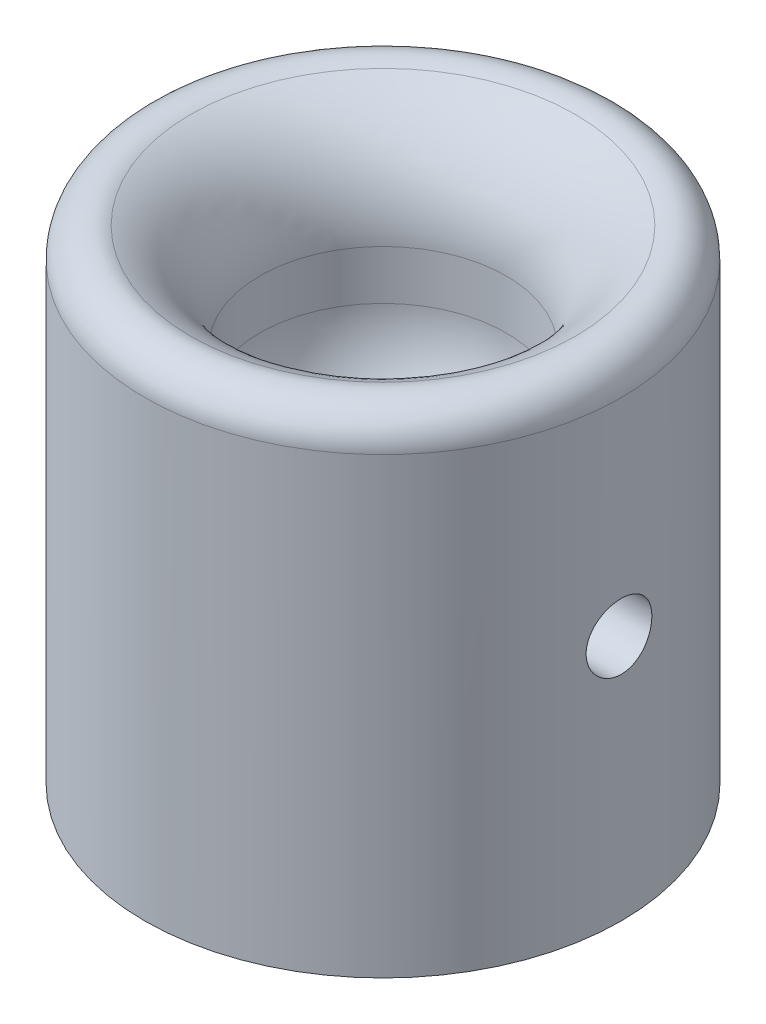
ISO-10303-21;
HEADER;
FILE_DESCRIPTION(('STEP AP214'),'2;1');
FILE_NAME('part.step','',(''),(''),'','','');
FILE_SCHEMA(('AUTOMOTIVE_DESIGN { 1 0 10303 214 1 1 1 1 }'));
ENDSEC;
DATA;
#1=APPLICATION_CONTEXT('core data for automotive mechanical design processes');
#2=APPLICATION_PROTOCOL_DEFINITION('international standard','automotive_design',2000,#1);
#3=PRODUCT_CONTEXT('',#1,'mechanical');
#4=PRODUCT('Part','Part','',(#3));
#5=PRODUCT_RELATED_PRODUCT_CATEGORY('part','',(#4));
#6=PRODUCT_DEFINITION_FORMATION('','',#4);
#7=PRODUCT_DEFINITION_CONTEXT('part definition',#1,'design');
#8=PRODUCT_DEFINITION('design','',#6,#7);
#9=PRODUCT_DEFINITION_SHAPE('','',#8);
#10=(LENGTH_UNIT() NAMED_UNIT(*) SI_UNIT(.MILLI.,.METRE.));
#11=(NAMED_UNIT(*) PLANE_ANGLE_UNIT() SI_UNIT($,.RADIAN.));
#12=(NAMED_UNIT(*) SI_UNIT($,.STERADIAN.) SOLID_ANGLE_UNIT());
#13=UNCERTAINTY_MEASURE_WITH_UNIT(LENGTH_MEASURE(1.E-05),#10,'distance_accuracy_value','');
#14=(GEOMETRIC_REPRESENTATION_CONTEXT(3) GLOBAL_UNCERTAINTY_ASSIGNED_CONTEXT((#13)) GLOBAL_UNIT_ASSIGNED_CONTEXT((#10,
#11,#12)) REPRESENTATION_CONTEXT('',''));
#15=CARTESIAN_POINT('',(0.,0.,0.));
#16=DIRECTION('',(0.,0.,1.));
#17=DIRECTION('',(1.,0.,0.));
#18=AXIS2_PLACEMENT_3D('',#15,#16,#17);
#19=CARTESIAN_POINT('',(0.,0.,0.));
#20=DIRECTION('',(0.,1.,0.));
#21=DIRECTION('',(0.,0.,1.));
#22=AXIS2_PLACEMENT_3D('',#19,#20,#21);
#23=PLANE('',#22);
#24=CARTESIAN_POINT('',(7.25,0.,0.));
#25=DIRECTION('',(0.,1.,0.));
#26=DIRECTION('',(0.,0.,1.));
#27=AXIS2_PLACEMENT_3D('',#24,#25,#26);
#28=CIRCLE('',#27,2.);
#29=CARTESIAN_POINT('',(7.25,0.,2.));
#30=VERTEX_POINT('',#29);
#31=EDGE_CURVE('E94',#30,#30,#28,.F.);
#32=ORIENTED_EDGE('',*,*,#31,.F.);
#33=EDGE_LOOP('',(#32));
#34=FACE_BOUND('',#33,.T.);
#35=CARTESIAN_POINT('',(0.,0.,0.));
#36=DIRECTION('',(0.,1.,0.));
#37=DIRECTION('',(0.,0.,1.));
#38=AXIS2_PLACEMENT_3D('',#35,#36,#37);
#39=CIRCLE('',#38,14.5);
#40=CARTESIAN_POINT('',(0.,0.,14.5));
#41=VERTEX_POINT('',#40);
#42=EDGE_CURVE('E127',#41,#41,#39,.T.);
#43=ORIENTED_EDGE('',*,*,#42,.F.);
#44=EDGE_LOOP('',(#43));
#45=FACE_BOUND('',#44,.T.);
#46=CARTESIAN_POINT('',(0.,0.,0.));
#47=DIRECTION('',(0.,1.,0.));
#48=DIRECTION('',(0.,0.,1.));
#49=AXIS2_PLACEMENT_3D('',#46,#47,#48);
#50=CIRCLE('',#49,3.175);
#51=CARTESIAN_POINT('',(0.,0.,3.175));
#52=VERTEX_POINT('',#51);
#53=EDGE_CURVE('E131',#52,#52,#50,.T.);
#54=ORIENTED_EDGE('',*,*,#53,.T.);
#55=EDGE_LOOP('',(#54));
#56=FACE_BOUND('',#55,.T.);
#57=CARTESIAN_POINT('',(-7.25,0.,0.));
#58=DIRECTION('',(0.,1.,0.));
#59=DIRECTION('',(0.,0.,1.));
#60=AXIS2_PLACEMENT_3D('',#57,#58,#59);
#61=CIRCLE('',#60,2.);
#62=CARTESIAN_POINT('',(-7.25,0.,2.));
#63=VERTEX_POINT('',#62);
#64=EDGE_CURVE('E65',#63,#63,#61,.T.);
#65=ORIENTED_EDGE('',*,*,#64,.T.);
#66=EDGE_LOOP('',(#65));
#67=FACE_BOUND('',#66,.T.);
#68=ADVANCED_FACE('F33',(#34,#45,#56,#67),#23,.F.);
#69=CARTESIAN_POINT('',(0.,30.,0.));
#70=DIRECTION('',(0.,-1.,0.));
#71=DIRECTION('',(0.,0.,-1.));
#72=AXIS2_PLACEMENT_3D('',#69,#70,#71);
#73=CYLINDRICAL_SURFACE('',#72,14.5);
#74=CARTESIAN_POINT('',(-14.5,13.,0.));
#75=CARTESIAN_POINT('',(-14.4999983145304,13.0000046834474,-0.111771782255016));
#76=CARTESIAN_POINT('',(-14.4986940304641,13.0094013112958,-0.223610945467072));
#77=CARTESIAN_POINT('',(-14.4936164731435,13.0467340474412,-0.444170253150493));
#78=CARTESIAN_POINT('',(-14.4898407079737,13.0746888677756,-0.552887133913179));
#79=CARTESIAN_POINT('',(-14.4802450300764,13.148292773718,-0.763977449731496));
#80=CARTESIAN_POINT('',(-14.4744265776484,13.1939292212912,-0.866355355121735));
#81=CARTESIAN_POINT('',(-14.4613905746173,13.3015716315056,-1.06198220004484));
#82=CARTESIAN_POINT('',(-14.4541732413289,13.3635750520949,-1.15523255415147));
#83=CARTESIAN_POINT('',(-14.439090026744,13.5026313545902,-1.33059490257932));
#84=CARTESIAN_POINT('',(-14.4312205466596,13.5797714697079,-1.4126374216345));
#85=CARTESIAN_POINT('',(-14.4157485695573,13.7467238679877,-1.56265631524633));
#86=CARTESIAN_POINT('',(-14.4081460870026,13.83653683632,-1.63063192877154));
#87=CARTESIAN_POINT('',(-14.3940337797335,14.0267448609364,-1.75085222768552));
#88=CARTESIAN_POINT('',(-14.387528601152,14.1271821215137,-1.80303073157084));
#89=CARTESIAN_POINT('',(-14.3763958401487,14.3354990276636,-1.88975287311594));
#90=CARTESIAN_POINT('',(-14.371768171242,14.4433783301613,-1.92429732308241));
#91=CARTESIAN_POINT('',(-14.364949334221,14.662790834289,-1.97455724619643));
#92=CARTESIAN_POINT('',(-14.3627428801251,14.7742964820044,-1.99039089662152));
#93=CARTESIAN_POINT('',(-14.3609697255537,14.9984023425616,-2.00314565332517));
#94=CARTESIAN_POINT('',(-14.3614028965333,15.1110025018361,-2.00006768056576));
#95=CARTESIAN_POINT('',(-14.3648460628672,15.3332719590756,-1.97518335555223));
#96=CARTESIAN_POINT('',(-14.3678380491279,15.4429562294512,-1.95350789010315));
#97=CARTESIAN_POINT('',(-14.3760336186403,15.65711578347,-1.89224841606513));
#98=CARTESIAN_POINT('',(-14.381237255547,15.7615909406705,-1.85266397299995));
#99=CARTESIAN_POINT('',(-14.3932899730117,15.9627690631382,-1.756571779847));
#100=CARTESIAN_POINT('',(-14.4001444992213,16.0594448621523,-1.7000078655931));
#101=CARTESIAN_POINT('',(-14.4147225990986,16.2419820617624,-1.57160245870337));
#102=CARTESIAN_POINT('',(-14.4224462210843,16.3278428605296,-1.4997601164572));
#103=CARTESIAN_POINT('',(-14.4379720826066,16.4870719413738,-1.34211523789643));
#104=CARTESIAN_POINT('',(-14.4457744356076,16.5603287010207,-1.25620002309771));
#105=CARTESIAN_POINT('',(-14.4605178909198,16.6913994643883,-1.07323422973863));
#106=CARTESIAN_POINT('',(-14.4674589904367,16.7492134180034,-0.976183615049901));
#107=CARTESIAN_POINT('',(-14.4797035649538,16.8477603126541,-0.773610653626885));
#108=CARTESIAN_POINT('',(-14.485006293298,16.8884854688179,-0.668084471836535));
#109=CARTESIAN_POINT('',(-14.4933701764699,16.9516060432217,-0.451601724985182));
#110=CARTESIAN_POINT('',(-14.4964314592463,16.974002507728,-0.340645470275087));
#111=CARTESIAN_POINT('',(-14.499950744306,16.9996835478943,-0.117415617081674));
#112=CARTESIAN_POINT('',(-14.5004296509885,17.0031215975551,-0.00515999171125079));
#113=CARTESIAN_POINT('',(-14.4987868946504,16.991194396561,0.21832598143994));
#114=CARTESIAN_POINT('',(-14.4966652993867,16.9758296358204,0.329556355857925));
#115=CARTESIAN_POINT('',(-14.4900728834365,16.9268605319016,0.547375596838828));
#116=CARTESIAN_POINT('',(-14.4856115920925,16.8933301572435,0.653981405715147));
#117=CARTESIAN_POINT('',(-14.4748387848992,16.809059076077,0.860057551874811));
#118=CARTESIAN_POINT('',(-14.4685271940518,16.7583176719418,0.959527599721316));
#119=CARTESIAN_POINT('',(-14.4547042200532,16.6406991584116,1.14918885020547));
#120=CARTESIAN_POINT('',(-14.4471856237026,16.5737237216429,1.23931854001307));
#121=CARTESIAN_POINT('',(-14.4318102158341,16.425676333861,1.40711288875201));
#122=CARTESIAN_POINT('',(-14.423953387849,16.3446036959156,1.4847769398995));
#123=CARTESIAN_POINT('',(-14.4087216361406,16.169983584765,1.6259868573837));
#124=CARTESIAN_POINT('',(-14.4013504582519,16.0763529994696,1.68943041154324));
#125=CARTESIAN_POINT('',(-14.3879885861327,15.879674249697,1.79968944890341));
#126=CARTESIAN_POINT('',(-14.3819978593068,15.776626307664,1.84650532473323));
#127=CARTESIAN_POINT('',(-14.3721015450655,15.5643556952836,1.92201791311758));
#128=CARTESIAN_POINT('',(-14.3681895447425,15.455153178665,1.95077040216642));
#129=CARTESIAN_POINT('',(-14.3628759068918,15.2334119663617,1.98951867875624));
#130=CARTESIAN_POINT('',(-14.3614741248611,15.1208734630953,1.99951554598356));
#131=CARTESIAN_POINT('',(-14.3613444524612,14.8966735724001,2.0004460782285));
#132=CARTESIAN_POINT('',(-14.3625940089465,14.7850128316856,1.99154053307902));
#133=CARTESIAN_POINT('',(-14.3675774730918,14.56479230137,1.9552615439198));
#134=CARTESIAN_POINT('',(-14.3713113790711,14.4562325096709,1.9278881124051));
#135=CARTESIAN_POINT('',(-14.3808353986625,14.2453283043831,1.85550397444985));
#136=CARTESIAN_POINT('',(-14.3866244057225,14.1429805806169,1.81050275819885));
#137=CARTESIAN_POINT('',(-14.399607924192,13.94726243623,1.7041562957287));
#138=CARTESIAN_POINT('',(-14.4068024682007,13.8538922239025,1.64281067041651));
#139=CARTESIAN_POINT('',(-14.421859538483,13.6779599238143,1.5049261358674));
#140=CARTESIAN_POINT('',(-14.4297270218845,13.5954919216411,1.42826770925532));
#141=CARTESIAN_POINT('',(-14.4452008978638,13.4445313255069,1.2621853422954));
#142=CARTESIAN_POINT('',(-14.4528072289262,13.3760420057456,1.17275841952479));
#143=CARTESIAN_POINT('',(-14.4669414028435,13.2547056876633,0.983195939897374));
#144=CARTESIAN_POINT('',(-14.4734640935461,13.2019325205128,0.883012756117933));
#145=CARTESIAN_POINT('',(-14.4846448909311,13.1140376339926,0.675166996113411));
#146=CARTESIAN_POINT('',(-14.4893049758408,13.07889717717,0.567512498421442));
#147=CARTESIAN_POINT('',(-14.4951414673414,13.0354605147008,0.382780409393608));
#148=CARTESIAN_POINT('',(-14.4969543048092,13.0221825251959,0.306856193752554));
#149=CARTESIAN_POINT('',(-14.4993841458831,13.0044506975116,0.153965304348375));
#150=CARTESIAN_POINT('',(-14.5000011611059,12.9999967736125,0.0769986407192193));
#151=CARTESIAN_POINT('',(-14.5,13.,0.));
#152=B_SPLINE_CURVE_WITH_KNOTS('',3,(#74,#75,#76,#77,#78,#79,#80,#81,#82,#83,#84,#85,#86,#87,
#88,#89,#90,#91,#92,#93,#94,#95,#96,#97,#98,#99,#100,#101,#102,#103,#104,#105,#106,#107,#108,
#109,#110,#111,#112,#113,#114,#115,#116,#117,#118,#119,#120,#121,#122,#123,#124,#125,#126,#127,
#128,#129,#130,#131,#132,#133,#134,#135,#136,#137,#138,#139,#140,#141,#142,#143,#144,#145,#146,
#147,#148,#149,#150,#151),.UNSPECIFIED.,.T.,.F.,(4,2,2,2,2,2,2,2,2,2,2,2,2,2,2,2,2,2,2,2,2,2,2,
2,2,2,2,2,2,2,2,2,2,2,2,2,2,2,4),(0.,0.335034041900406,0.670406409349955,1.00553950856274,
1.34062058685763,1.67769268156906,2.01478300740016,2.35326661939162,2.69173463784306,
3.02805327039063,3.36435552495573,3.69831016124934,4.0322728997999,4.36735271595418,
4.70245117026609,5.04037712041041,5.3783041669734,5.71638499089566,6.05444651462918,
6.38976726737104,6.72507928339099,7.05903609419514,7.393006443123,7.72905250208165,
8.06511494057562,8.40352272845118,8.74192252497614,9.07927220045392,9.4166024554605,
9.75107477879538,10.0855468758325,10.4198391515971,10.7541391816283,11.0911582656328,
11.428256198602,11.766913632115,12.105210424081,12.3360147997982,12.5668169334006),.UNSPECIFIED.);
#153=CARTESIAN_POINT('',(-14.5,13.,0.));
#154=VERTEX_POINT('',#153);
#155=EDGE_CURVE('E93',#154,#154,#152,.T.);
#156=ORIENTED_EDGE('',*,*,#155,.T.);
#157=EDGE_LOOP('',(#156));
#158=FACE_BOUND('',#157,.T.);
#159=CARTESIAN_POINT('',(14.3614066163451,15.,-2.));
#160=CARTESIAN_POINT('',(14.3614083625701,14.8882339192475,-1.99999531160166));
#161=CARTESIAN_POINT('',(14.3627254295864,14.776400441491,-1.99059961001874));
#162=CARTESIAN_POINT('',(14.3678486244426,14.5558529449147,-1.95327088709236));
#163=CARTESIAN_POINT('',(14.371657267476,14.447142194309,-1.92531913338241));
#164=CARTESIAN_POINT('',(14.3813242074303,14.2360648468641,-1.8517241965142));
#165=CARTESIAN_POINT('',(14.3871810230401,14.133693727794,-1.80609379661412));
#166=CARTESIAN_POINT('',(14.4002826236974,13.9380782758978,-1.69846563271024));
#167=CARTESIAN_POINT('',(14.4075271943674,13.8448325367585,-1.63647039615496));
#168=CARTESIAN_POINT('',(14.4226430437203,13.6694650682146,-1.4974223989857));
#169=CARTESIAN_POINT('',(14.4305178577144,13.5874142543897,-1.42028057335359));
#170=CARTESIAN_POINT('',(14.4459752335317,13.4373793256453,-1.25332125913333));
#171=CARTESIAN_POINT('',(14.4535577800559,13.3693959462836,-1.16350310813857));
#172=CARTESIAN_POINT('',(14.4676128967092,13.2491674541495,-0.973290452287546));
#173=CARTESIAN_POINT('',(14.4740808528128,13.1969871164741,-0.872854634802141));
#174=CARTESIAN_POINT('',(14.4851390104675,13.1102611878165,-0.664540862123759));
#175=CARTESIAN_POINT('',(14.4897292962705,13.0757148055738,-0.556663241101609));
#176=CARTESIAN_POINT('',(14.4964899898084,13.0254509515881,-0.337256253733143));
#177=CARTESIAN_POINT('',(14.4986756058742,13.0096150974716,-0.225754483713472));
#178=CARTESIAN_POINT('',(14.5004327314837,12.9968545894437,-0.00165624290616804));
#179=CARTESIAN_POINT('',(14.5000043649225,12.9999290392398,0.110940175745803));
#180=CARTESIAN_POINT('',(14.496594018656,13.024807713458,0.333224973143078));
#181=CARTESIAN_POINT('',(14.4936294005615,13.0464846002245,0.442927907846335));
#182=CARTESIAN_POINT('',(14.4854990487806,13.1077533580355,0.657124053813943));
#183=CARTESIAN_POINT('',(14.4803332657409,13.147345630771,0.761617148207219));
#184=CARTESIAN_POINT('',(14.4683510916218,13.243454184091,0.962817297353837));
#185=CARTESIAN_POINT('',(14.4615294122443,13.3000248267298,1.05949805689999));
#186=CARTESIAN_POINT('',(14.4469972159453,13.4284446741172,1.24204233885163));
#187=CARTESIAN_POINT('',(14.4392866494628,13.500294730977,1.32790525753614));
#188=CARTESIAN_POINT('',(14.4237623969894,13.6579451742219,1.48712589886147));
#189=CARTESIAN_POINT('',(14.4159483867633,13.7438566411935,1.56037364831337));
#190=CARTESIAN_POINT('',(14.401160871778,13.9268116931912,1.69142800485719));
#191=CARTESIAN_POINT('',(14.3941873707967,14.0238553282505,1.74923454254509));
#192=CARTESIAN_POINT('',(14.3818706412671,14.2264262083133,1.84777606376466));
#193=CARTESIAN_POINT('',(14.3765283720676,14.3319583996345,1.88850100662797));
#194=CARTESIAN_POINT('',(14.3680967931091,14.5484542369869,1.9516193216908));
#195=CARTESIAN_POINT('',(14.3650073501391,14.6594175614578,1.97401377779272));
#196=CARTESIAN_POINT('',(14.3614560645899,14.8826510022969,1.99968722359251));
#197=CARTESIAN_POINT('',(14.3609728721167,14.9949029280791,2.00312153655887));
#198=CARTESIAN_POINT('',(14.3626322271079,15.2183806116254,1.99118818249391));
#199=CARTESIAN_POINT('',(14.3647747060568,15.3296063960898,1.97582100607775));
#200=CARTESIAN_POINT('',(14.3714244566748,15.5474012725679,1.92685214913448));
#201=CARTESIAN_POINT('',(14.3759218326507,15.6539878445944,1.89332675253117));
#202=CARTESIAN_POINT('',(14.3867665521429,15.86002771211,1.80907205016032));
#203=CARTESIAN_POINT('',(14.3931139738674,15.959480705815,1.75834201707481));
#204=CARTESIAN_POINT('',(14.406994323589,16.1491298505101,1.64074051048974));
#205=CARTESIAN_POINT('',(14.4145345775159,16.2392626966977,1.57376782819061));
#206=CARTESIAN_POINT('',(14.4299284726678,16.407064691853,1.42572402089194));
#207=CARTESIAN_POINT('',(14.4377821287892,16.4847332474926,1.34465222512572));
#208=CARTESIAN_POINT('',(14.4529840811805,16.625953594722,1.17003025307234));
#209=CARTESIAN_POINT('',(14.4603284601594,16.6894028881701,1.0763967938825));
#210=CARTESIAN_POINT('',(14.4736246655395,16.7996719857006,0.87971069921979));
#211=CARTESIAN_POINT('',(14.4795765251025,16.8464921858045,0.776658288132496));
#212=CARTESIAN_POINT('',(14.4893998089259,16.9220074889183,0.564389934838081));
#213=CARTESIAN_POINT('',(14.4932778442616,16.9507602404833,0.455194820066887));
#214=CARTESIAN_POINT('',(14.4985441365321,16.9895115476872,0.233469274771302));
#215=CARTESIAN_POINT('',(14.4999325314715,16.9995111428439,0.120939029469841));
#216=CARTESIAN_POINT('',(14.5000620972535,17.0004499176655,-0.103265006985071));
#217=CARTESIAN_POINT('',(14.4988251336977,16.9915465327814,-0.214938158626526));
#218=CARTESIAN_POINT('',(14.4938867279694,16.9552675106141,-0.435184065926982));
#219=CARTESIAN_POINT('',(14.4901852903377,16.9278919073672,-0.54375682729826));
#220=CARTESIAN_POINT('',(14.4807318657505,16.8554982224758,-0.754688060921664));
#221=CARTESIAN_POINT('',(14.474980950937,16.8104893640869,-0.857049749665678));
#222=CARTESIAN_POINT('',(14.4620628164094,16.7041232728623,-1.05279265541694));
#223=CARTESIAN_POINT('',(14.454895565226,16.6427656767673,-1.14617367281622));
#224=CARTESIAN_POINT('',(14.4398720472284,16.5048676354373,-1.32210615684901));
#225=CARTESIAN_POINT('',(14.4320107584594,16.4282104319823,-1.40456568512367));
#226=CARTESIAN_POINT('',(14.4165239254039,16.2621340437102,-1.55550975346759));
#227=CARTESIAN_POINT('',(14.4088984370908,16.1727118566536,-1.62399099670401));
#228=CARTESIAN_POINT('',(14.3947082051736,15.9831535665906,-1.74531821928251));
#229=CARTESIAN_POINT('',(14.3881486281202,15.8829689736466,-1.79808901895741));
#230=CARTESIAN_POINT('',(14.3768933882765,15.67512029958,-1.88597909381692));
#231=CARTESIAN_POINT('',(14.3721957451883,15.5674643088441,-1.9211171333275));
#232=CARTESIAN_POINT('',(14.3663096989907,15.3827386239448,-1.96454727304452));
#233=CARTESIAN_POINT('',(14.364480489359,15.3068227609561,-1.97782232978071));
#234=CARTESIAN_POINT('',(14.36202835266,15.1539485853218,-1.99555026367846));
#235=CARTESIAN_POINT('',(14.3614054134546,15.0769902831735,-2.00000322961236));
#236=CARTESIAN_POINT('',(14.3614066163451,15.,-2.));
#237=B_SPLINE_CURVE_WITH_KNOTS('',3,(#159,#160,#161,#162,#163,#164,#165,#166,#167,#168,#169,
#170,#171,#172,#173,#174,#175,#176,#177,#178,#179,#180,#181,#182,#183,#184,#185,#186,#187,#188,
#189,#190,#191,#192,#193,#194,#195,#196,#197,#198,#199,#200,#201,#202,#203,#204,#205,#206,#207,
#208,#209,#210,#211,#212,#213,#214,#215,#216,#217,#218,#219,#220,#221,#222,#223,#224,#225,#226,
#227,#228,#229,#230,#231,#232,#233,#234,#235,#236),.UNSPECIFIED.,.T.,.F.,(4,2,2,2,2,2,2,2,2,2,2,
2,2,2,2,2,2,2,2,2,2,2,2,2,2,2,2,2,2,2,2,2,2,2,2,2,2,2,4),(0.,0.335016912350329,
0.670372540182193,1.005486126825,1.34054798748365,1.67764250380776,2.0147546416712,
2.35323042840812,2.69169102592411,3.02799850071748,3.36429003565396,3.6982977794911,
4.03231301267429,4.36740933083253,4.70252434173616,5.04042718053408,5.37833153808709,
5.71643424052424,6.05451694912175,6.3898258963526,6.72512609405617,7.05902847661868,
7.39294497650838,7.72899814288521,8.0650673013993,8.40348618168419,8.74189700199226,
9.07922248360191,9.416529266164,9.75103777928711,10.0855456760593,10.4198788381359,
10.7542194295176,11.0912164406832,11.428292842297,11.7669572542983,12.1052605000562,
12.3360398771512,12.5668169320152),.UNSPECIFIED.);
#238=CARTESIAN_POINT('',(14.3614066163451,15.,-2.));
#239=VERTEX_POINT('',#238);
#240=EDGE_CURVE('E63',#239,#239,#237,.T.);
#241=ORIENTED_EDGE('',*,*,#240,.T.);
#242=EDGE_LOOP('',(#241));
#243=FACE_BOUND('',#242,.T.);
#244=CARTESIAN_POINT('',(0.,27.582575694956,0.));
#245=DIRECTION('',(0.,-1.,0.));
#246=DIRECTION('',(0.,0.,-1.));
#247=AXIS2_PLACEMENT_3D('',#244,#245,#246);
#248=CIRCLE('',#247,14.5);
#249=CARTESIAN_POINT('',(0.,27.582575694956,-14.5));
#250=VERTEX_POINT('',#249);
#251=EDGE_CURVE('E11',#250,#250,#248,.T.);
#252=ORIENTED_EDGE('',*,*,#251,.T.);
#253=EDGE_LOOP('',(#252));
#254=FACE_BOUND('',#253,.T.);
#255=ORIENTED_EDGE('',*,*,#42,.T.);
#256=EDGE_LOOP('',(#255));
#257=FACE_BOUND('',#256,.T.);
#258=ADVANCED_FACE('F99',(#158,#243,#254,#257),#73,.T.);
#259=CARTESIAN_POINT('',(0.,13.,0.));
#260=DIRECTION('',(0.,1.,0.));
#261=DIRECTION('',(0.,0.,1.));
#262=AXIS2_PLACEMENT_3D('',#259,#260,#261);
#263=CYLINDRICAL_SURFACE('',#262,7.5);
#264=CARTESIAN_POINT('',(0.,23.,0.));
#265=DIRECTION('',(0.,1.,0.));
#266=DIRECTION('',(0.,0.,1.));
#267=AXIS2_PLACEMENT_3D('',#264,#265,#266);
#268=CIRCLE('',#267,7.5);
#269=CARTESIAN_POINT('',(0.,23.,7.5));
#270=VERTEX_POINT('',#269);
#271=EDGE_CURVE('E255',#270,#270,#268,.T.);
#272=ORIENTED_EDGE('',*,*,#271,.T.);
#273=EDGE_LOOP('',(#272));
#274=FACE_BOUND('',#273,.T.);
#275=CARTESIAN_POINT('',(0.,20.,0.));
#276=DIRECTION('',(0.,1.,0.));
#277=DIRECTION('',(0.,0.,1.));
#278=AXIS2_PLACEMENT_3D('',#275,#276,#277);
#279=CIRCLE('',#278,7.5);
#280=CARTESIAN_POINT('',(0.,20.,7.5));
#281=VERTEX_POINT('',#280);
#282=EDGE_CURVE('E258',#281,#281,#279,.F.);
#283=ORIENTED_EDGE('',*,*,#282,.T.);
#284=EDGE_LOOP('',(#283));
#285=FACE_BOUND('',#284,.T.);
#286=ADVANCED_FACE('F103',(#274,#285),#263,.F.);
#287=CARTESIAN_POINT('',(0.,13.,0.));
#288=DIRECTION('',(0.,1.,0.));
#289=DIRECTION('',(0.,0.,1.));
#290=AXIS2_PLACEMENT_3D('',#287,#288,#289);
#291=PLANE('',#290);
#292=CARTESIAN_POINT('',(0.,13.,0.));
#293=DIRECTION('',(0.,1.,0.));
#294=DIRECTION('',(0.,0.,1.));
#295=AXIS2_PLACEMENT_3D('',#292,#293,#294);
#296=CIRCLE('',#295,0.5);
#297=CARTESIAN_POINT('',(-0.5,13.,0.));
#298=VERTEX_POINT('',#297);
#299=CARTESIAN_POINT('',(0.5,13.,0.));
#300=VERTEX_POINT('',#299);
#301=EDGE_CURVE('E260',#298,#300,#296,.T.);
#302=ORIENTED_EDGE('',*,*,#301,.T.);
#303=EDGE_CURVE('E263',#300,#298,#296,.T.);
#304=ORIENTED_EDGE('',*,*,#303,.T.);
#305=EDGE_LOOP('',(#302,#304));
#306=FACE_BOUND('',#305,.T.);
#307=ADVANCED_FACE('F81',(#306),#291,.T.);
#308=CARTESIAN_POINT('',(0.,23.,0.));
#309=DIRECTION('',(0.,1.,0.));
#310=DIRECTION('',(0.,0.,1.));
#311=AXIS2_PLACEMENT_3D('',#308,#309,#310);
#312=TOROIDAL_SURFACE('',#311,14.5,7.);
#313=CARTESIAN_POINT('',(0.,29.4156059729382,0.));
#314=DIRECTION('',(0.,-1.,0.));
#315=DIRECTION('',(0.,0.,-1.));
#316=AXIS2_PLACEMENT_3D('',#313,#314,#315);
#317=CIRCLE('',#316,11.7000000000001);
#318=CARTESIAN_POINT('',(0.,29.4156059729382,-11.7000000000001));
#319=VERTEX_POINT('',#318);
#320=EDGE_CURVE('E46',#319,#319,#317,.F.);
#321=ORIENTED_EDGE('',*,*,#320,.T.);
#322=EDGE_LOOP('',(#321));
#323=FACE_BOUND('',#322,.T.);
#324=ORIENTED_EDGE('',*,*,#271,.F.);
#325=EDGE_LOOP('',(#324));
#326=FACE_BOUND('',#325,.T.);
#327=ADVANCED_FACE('F105',(#323,#326),#312,.T.);
#328=CARTESIAN_POINT('',(0.,20.,0.));
#329=DIRECTION('',(0.,1.,0.));
#330=DIRECTION('',(0.,0.,1.));
#331=AXIS2_PLACEMENT_3D('',#328,#329,#330);
#332=DEGENERATE_TOROIDAL_SURFACE('',#331,0.5,7.,.T.);
#333=ORIENTED_EDGE('',*,*,#282,.F.);
#334=EDGE_LOOP('',(#333));
#335=FACE_BOUND('',#334,.T.);
#336=ORIENTED_EDGE('',*,*,#301,.F.);
#337=CARTESIAN_POINT('',(-0.499999999999987,13.,0.));
#338=CARTESIAN_POINT('',(-0.500000177858631,13.0000000000003,0.000116704905490954));
#339=CARTESIAN_POINT('',(-0.500361253902115,13.0000000101989,0.000233408778707286));
#340=CARTESIAN_POINT('',(-0.501175584150259,13.0000000668561,0.000557744120258602));
#341=CARTESIAN_POINT('',(-0.501481849311471,13.0000001353585,0.00076544928973105));
#342=CARTESIAN_POINT('',(-0.502756840196968,13.0000005182064,0.00155336644828601));
#343=CARTESIAN_POINT('',(-0.503928111524426,13.0000010531243,0.00213318726351014));
#344=CARTESIAN_POINT('',(-0.508468273150262,13.0000041870308,0.00444215556342383));
#345=CARTESIAN_POINT('',(-0.511601445299879,13.0000087758933,0.00617611831489105));
#346=CARTESIAN_POINT('',(-0.554486741273197,13.0001026655095,0.0298855916803248));
#347=CARTESIAN_POINT('',(-0.595695960577671,13.0005561017619,0.0523862819350023));
#348=CARTESIAN_POINT('',(-0.680383549072385,13.0023470283224,0.0999972141487661));
#349=CARTESIAN_POINT('',(-0.72374517030332,13.0037583676148,0.125163577248516));
#350=CARTESIAN_POINT('',(-0.799875457397344,13.0071179233627,0.169676505973798));
#351=CARTESIAN_POINT('',(-0.832634213131805,13.0088496124025,0.18893684249733));
#352=CARTESIAN_POINT('',(-0.897236646581693,13.0128518784858,0.227165460419802));
#353=CARTESIAN_POINT('',(-0.92908420652811,13.0151093199035,0.246130436860301));
#354=CARTESIAN_POINT('',(-1.10214979564441,13.0289411043272,0.349510643754526));
#355=CARTESIAN_POINT('',(-1.24263626498489,13.045846567763,0.434594693377315));
#356=CARTESIAN_POINT('',(-1.5239107722388,13.0913357190486,0.603981513790391));
#357=CARTESIAN_POINT('',(-1.66468995355443,13.1200241132125,0.688270163042854));
#358=CARTESIAN_POINT('',(-1.95920547166316,13.1924543024046,0.861652702793743));
#359=CARTESIAN_POINT('',(-2.11285244082814,13.2374003707488,0.95040230157966));
#360=CARTESIAN_POINT('',(-2.41855840365304,13.3410219513903,1.12150653454409));
#361=CARTESIAN_POINT('',(-2.57062033098453,13.3996641303481,1.2038760584151));
#362=CARTESIAN_POINT('',(-2.86915982780384,13.5285997305159,1.35824117069593));
#363=CARTESIAN_POINT('',(-3.01567734139324,13.5985359285524,1.43045676377701));
#364=CARTESIAN_POINT('',(-3.30703900052798,13.7506586000415,1.56507830677347));
#365=CARTESIAN_POINT('',(-3.45188185875609,13.832853899577,1.62747712192326));
#366=CARTESIAN_POINT('',(-3.73575517138815,14.0065640502983,1.73881043713844));
#367=CARTESIAN_POINT('',(-3.87484077249142,14.0977980410226,1.78803984096085));
#368=CARTESIAN_POINT('',(-4.15025161487169,14.2902433102134,1.87277828097858));
#369=CARTESIAN_POINT('',(-4.28657735027262,14.3914527832912,1.90828979417157));
#370=CARTESIAN_POINT('',(-4.59141140396345,14.630589354396,1.97042571289179));
#371=CARTESIAN_POINT('',(-4.75889588354717,14.7711481509798,1.99221595081555));
#372=CARTESIAN_POINT('',(-5.08672181507802,15.0630761615984,2.00434738478162));
#373=CARTESIAN_POINT('',(-5.24703980658441,15.2144771814183,1.99459200926312));
#374=CARTESIAN_POINT('',(-5.52026621056582,15.4857056720962,1.94381794580756));
#375=CARTESIAN_POINT('',(-5.635498730352,15.6046435319536,1.91063781359784));
#376=CARTESIAN_POINT('',(-5.85702748597019,15.8410084248979,1.8189855743756));
#377=CARTESIAN_POINT('',(-5.96334206030253,15.9584381158246,1.76056696901578));
#378=CARTESIAN_POINT('',(-6.14068491186737,16.1598459808898,1.63263897742613));
#379=CARTESIAN_POINT('',(-6.21418031118256,16.2452688320479,1.56883886843654));
#380=CARTESIAN_POINT('',(-6.35213635917081,16.4085672396677,1.42401164338537));
#381=CARTESIAN_POINT('',(-6.41660663568338,16.4864508110992,1.34300312089854));
#382=CARTESIAN_POINT('',(-6.52344430613451,16.6174155747265,1.18017834366428));
#383=CARTESIAN_POINT('',(-6.56769999834153,16.6724338727012,1.10116735456194));
#384=CARTESIAN_POINT('',(-6.64702451029663,16.7719832734006,0.932546129705212));
#385=CARTESIAN_POINT('',(-6.68209666842689,16.8165181864307,0.842939762806366));
#386=CARTESIAN_POINT('',(-6.7417121451994,16.8927094256914,0.654267945739036));
#387=CARTESIAN_POINT('',(-6.76617976210349,16.9242730749078,0.555140463319775));
#388=CARTESIAN_POINT('',(-6.80285208621864,16.9717325855184,0.351027253290038));
#389=CARTESIAN_POINT('',(-6.81506573070353,16.9876398655185,0.246045854232441));
#390=CARTESIAN_POINT('',(-6.82579845984461,17.0016178638532,0.0471884529556284));
#391=CARTESIAN_POINT('',(-6.82580892332642,17.0016310442841,-0.0464765668834698));
#392=CARTESIAN_POINT('',(-6.81583320499782,16.9886398404975,-0.232339267888207));
#393=CARTESIAN_POINT('',(-6.80584948842037,16.9756386664899,-0.324537305212298));
#394=CARTESIAN_POINT('',(-6.77693594233188,16.9381773801447,-0.501329112721135));
#395=CARTESIAN_POINT('',(-6.7583593222828,16.9141699942758,-0.586078638424795));
#396=CARTESIAN_POINT('',(-6.71316631650553,16.8561704437679,-0.749785495109842));
#397=CARTESIAN_POINT('',(-6.68654871534773,16.8221767696788,-0.828741948198838));
#398=CARTESIAN_POINT('',(-6.62389517738821,16.742870938213,-0.985224985230211));
#399=CARTESIAN_POINT('',(-6.58729759368808,16.6968953854175,-1.06218785419793));
#400=CARTESIAN_POINT('',(-6.50704965551087,16.5972521943866,-1.20686299167711));
#401=CARTESIAN_POINT('',(-6.46339512481844,16.5435800035114,-1.27456973846659));
#402=CARTESIAN_POINT('',(-6.35019921307116,16.4062808253567,-1.42721042830064));
#403=CARTESIAN_POINT('',(-6.27756174130813,16.3196464988742,-1.50716222574292));
#404=CARTESIAN_POINT('',(-6.12287313020125,16.1393453881094,-1.64773224179748));
#405=CARTESIAN_POINT('',(-6.04080322595211,16.0456647182908,-1.70831098187177));
#406=CARTESIAN_POINT('',(-5.84201505993185,15.8245926492698,-1.82769382454471));
#407=CARTESIAN_POINT('',(-5.72260347939755,15.6959923177062,-1.8797490510673));
#408=CARTESIAN_POINT('',(-5.47476619516781,15.4394580743552,-1.9557108213476));
#409=CARTESIAN_POINT('',(-5.34633655113277,15.3115244804482,-1.97960497833047));
#410=CARTESIAN_POINT('',(-5.12823668170973,15.1037368428466,-1.99901772828062));
#411=CARTESIAN_POINT('',(-5.04041800721065,15.0224720696938,-2.00146682972022));
#412=CARTESIAN_POINT('',(-4.86250718194462,14.8629598682982,-1.99689210486934));
#413=CARTESIAN_POINT('',(-4.77241777818198,14.7847090588761,-1.98987923178474));
#414=CARTESIAN_POINT('',(-4.57580715066871,14.6196858598389,-1.96554810594419));
#415=CARTESIAN_POINT('',(-4.4689482568208,14.5335333658568,-1.94677028599988));
#416=CARTESIAN_POINT('',(-4.25302870876437,14.3668856706761,-1.89912645066145));
#417=CARTESIAN_POINT('',(-4.14396685820693,14.2863936559413,-1.87025480687984));
#418=CARTESIAN_POINT('',(-3.92356394472749,14.1313960008797,-1.80351853643915));
#419=CARTESIAN_POINT('',(-3.81221464251009,14.0569199330952,-1.76561272256446));
#420=CARTESIAN_POINT('',(-3.58802679482259,13.9148647359301,-1.68204482611091));
#421=CARTESIAN_POINT('',(-3.47518793204258,13.8472871037466,-1.6363810654968));
#422=CARTESIAN_POINT('',(-3.21547871758622,13.7009481524918,-1.52421864810462));
#423=CARTESIAN_POINT('',(-3.06819713343713,13.6245984105672,-1.45551249183218));
#424=CARTESIAN_POINT('',(-2.77207523310468,13.4846788834307,-1.30921574772783));
#425=CARTESIAN_POINT('',(-2.6232352566341,13.4211063715271,-1.23162706100852));
#426=CARTESIAN_POINT('',(-2.32559561675021,13.3076393518902,-1.07030608448341));
#427=CARTESIAN_POINT('',(-2.1768072040619,13.2576290153274,-0.986634097423006));
#428=CARTESIAN_POINT('',(-1.87825030179976,13.1708379551178,-0.814518820666659));
#429=CARTESIAN_POINT('',(-1.72848244297002,13.1340494353686,-0.726078378138252));
#430=CARTESIAN_POINT('',(-1.51244631411615,13.0907205557474,-0.596972196769105));
#431=CARTESIAN_POINT('',(-1.44656173985589,13.078801103621,-0.557394830318051));
#432=CARTESIAN_POINT('',(-1.31320615249379,13.0572861059856,-0.477099537447146));
#433=CARTESIAN_POINT('',(-1.24573046383933,13.0477436064035,-0.436374930679323));
#434=CARTESIAN_POINT('',(-1.12113377422203,13.0325876340736,-0.36127121197047));
#435=CARTESIAN_POINT('',(-1.06405268801523,13.0265923119424,-0.326901100971377));
#436=CARTESIAN_POINT('',(-0.953187597463284,13.0167683656841,-0.260474503387085));
#437=CARTESIAN_POINT('',(-0.899420376338673,13.0128277872951,-0.228407610424369));
#438=CARTESIAN_POINT('',(-0.821514825715581,13.0082831281928,-0.182392186206281));
#439=CARTESIAN_POINT('',(-0.797502614244912,13.0070413817083,-0.168270314458559));
#440=CARTESIAN_POINT('',(-0.748869299382724,13.0048446284038,-0.139864205639048));
#441=CARTESIAN_POINT('',(-0.724245723471498,13.0038959474643,-0.125582483936829));
#442=CARTESIAN_POINT('',(-0.667828796259569,13.0020810996276,-0.0930445491134254));
#443=CARTESIAN_POINT('',(-0.636044109101614,13.0013201563464,-0.0748471566054067));
#444=CARTESIAN_POINT('',(-0.574002545842181,13.0003382387335,-0.0403329321206344));
#445=CARTESIAN_POINT('',(-0.543824211772137,13.0000792515707,-0.0239813542511974));
#446=CARTESIAN_POINT('',(-0.511605680329154,13.0000087927464,-0.00617947126147821));
#447=CARTESIAN_POINT('',(-0.508480361771681,13.000004205311,-0.00444886019744524));
#448=CARTESIAN_POINT('',(-0.503942013700671,13.0000010603267,-0.00214075865503894));
#449=CARTESIAN_POINT('',(-0.502765386967927,13.0000005214142,-0.00155846648126606));
#450=CARTESIAN_POINT('',(-0.501485715111961,13.0000001360258,-0.000767374325354901));
#451=CARTESIAN_POINT('',(-0.501178605279637,13.0000000671258,-0.000558973137701833));
#452=CARTESIAN_POINT('',(-0.500361632399978,13.0000000102286,-0.00023376320931473));
#453=CARTESIAN_POINT('',(-0.499999821872843,12.9999999999997,-0.000116881086960523));
#454=CARTESIAN_POINT('',(-0.499999999999987,13.,0.));
#455=B_SPLINE_CURVE_WITH_KNOTS('',3,(#337,#338,#339,#340,#341,#342,#343,#344,#345,#346,#347,
#348,#349,#350,#351,#352,#353,#354,#355,#356,#357,#358,#359,#360,#361,#362,#363,#364,#365,#366,
#367,#368,#369,#370,#371,#372,#373,#374,#375,#376,#377,#378,#379,#380,#381,#382,#383,#384,#385,
#386,#387,#388,#389,#390,#391,#392,#393,#394,#395,#396,#397,#398,#399,#400,#401,#402,#403,#404,
#405,#406,#407,#408,#409,#410,#411,#412,#413,#414,#415,#416,#417,#418,#419,#420,#421,#422,#423,
#424,#425,#426,#427,#428,#429,#430,#431,#432,#433,#434,#435,#436,#437,#438,#439,#440,#441,#442,
#443,#444,#445,#446,#447,#448,#449,#450,#451,#452,#453,#454),.UNSPECIFIED.,.T.,.F.,(4,2,2,2,2,2,
2,2,2,2,2,2,2,2,2,2,2,2,2,2,2,2,2,2,2,2,2,2,2,2,2,2,2,2,2,2,2,2,2,2,2,2,2,2,2,2,2,2,2,2,2,2,2,2,
2,2,2,2,4),(0.,0.000742148250412603,0.00206192497012519,0.0057500275370249,0.0167332395936043,
0.155644221851326,0.306704024538401,0.420720137855408,0.532146138285525,1.02697369881457,
1.52629698423776,2.07479592886988,2.62197360741385,3.15438156974123,3.68717471243866,
4.20678712297092,4.72630566476939,5.38322058878448,6.04214844838119,6.54709364024136,
7.05097363869192,7.43806045575959,7.82473113637211,8.14134842079674,8.45785044877218,
8.77657607027466,9.09506906407914,9.3746336484965,9.65412929058538,9.92303749011718,
10.19198635666,10.4813551527897,10.7708958250034,11.1840222417444,11.5979852434413,
12.1441888338438,12.6906325848286,13.0492436593228,13.4074399606923,13.8225142698011,
14.2378203973981,14.6550574186985,15.0723848030704,15.6103124841051,16.1481252478978,
16.6811887509599,17.2139374211662,17.4472362268968,17.6853505431078,17.8860283945847,
18.0741702704685,18.1578401900647,18.2432069595897,18.3535331527097,18.4551161413895,
18.4660780822112,18.4697819258122,18.4711061123748,18.4718493809961),.UNSPECIFIED.);
#456=EDGE_CURVE('E37',#298,#298,#455,.T.);
#457=ORIENTED_EDGE('',*,*,#456,.T.);
#458=ORIENTED_EDGE('',*,*,#303,.F.);
#459=CARTESIAN_POINT('',(0.500000000000012,13.,0.));
#460=CARTESIAN_POINT('',(0.500000095879817,13.0000000000002,-0.000116688367733323));
#461=CARTESIAN_POINT('',(0.500361163733492,13.0000000101959,-0.000233376177063645));
#462=CARTESIAN_POINT('',(0.501175714061244,13.0000000668529,-0.000557757681313019));
#463=CARTESIAN_POINT('',(0.501482030499047,13.0000001353798,-0.000765525082066624));
#464=CARTESIAN_POINT('',(0.502757574631989,13.0000005184808,-0.00155385602192762));
#465=CARTESIAN_POINT('',(0.503929615301373,13.0000010539148,-0.00213402574498969));
#466=CARTESIAN_POINT('',(0.508469782934681,13.0000041891376,-0.00444294634647553));
#467=CARTESIAN_POINT('',(0.511602199327682,13.000008777473,-0.00617651457627757));
#468=CARTESIAN_POINT('',(0.554481457725748,13.0001026548412,-0.0298829313104458));
#469=CARTESIAN_POINT('',(0.595685983995103,13.0005559904539,-0.0523807960064977));
#470=CARTESIAN_POINT('',(0.680365834936524,13.0023465406609,-0.0999870006390802));
#471=CARTESIAN_POINT('',(0.723724318901868,13.0037576341417,-0.125151490851004));
#472=CARTESIAN_POINT('',(0.799855815855496,13.0071169187521,-0.169664983667286));
#473=CARTESIAN_POINT('',(0.832618899573915,13.0088487305844,-0.188927807552135));
#474=CARTESIAN_POINT('',(0.897229322652424,13.0128513586966,-0.227161094897097));
#475=CARTESIAN_POINT('',(0.929080548389088,13.0151090272057,-0.2461282501427));
#476=CARTESIAN_POINT('',(1.10215578325666,13.0289415843412,-0.349514227271936));
#477=CARTESIAN_POINT('',(1.24264820124667,13.0458480059478,-0.434601914126173));
#478=CARTESIAN_POINT('',(1.52393538403143,13.091340196987,-0.603996297490142));
#479=CARTESIAN_POINT('',(1.66472128595366,13.1200307477916,-0.688288861493137));
#480=CARTESIAN_POINT('',(1.9592371668666,13.1924632731503,-0.861671084959287));
#481=CARTESIAN_POINT('',(2.11287786092296,13.2374083914155,-0.950416759239888));
#482=CARTESIAN_POINT('',(2.41857114420938,13.3410268643048,-1.12151343543449));
#483=CARTESIAN_POINT('',(2.5706266687428,13.3996668673831,-1.20387933539723));
#484=CARTESIAN_POINT('',(2.86915831662839,13.5285990780191,-1.35824038938175));
#485=CARTESIAN_POINT('',(3.01567433571197,13.5985344938907,-1.43045528226212));
#486=CARTESIAN_POINT('',(3.3070331090494,13.7506553893309,-1.56507567750573));
#487=CARTESIAN_POINT('',(3.45187457520746,13.8328497003327,-1.62747404079583));
#488=CARTESIAN_POINT('',(3.73574800969576,14.0065594165379,-1.73880784737477));
#489=CARTESIAN_POINT('',(3.87483508019386,14.0977941857708,-1.78803795705014));
#490=CARTESIAN_POINT('',(4.15024881139435,14.2902412289725,-1.87277755088299));
#491=CARTESIAN_POINT('',(4.28657596623206,14.3914516975044,-1.90828951209678));
#492=CARTESIAN_POINT('',(4.59141174323094,14.6305896205868,-1.97042578199406));
#493=CARTESIAN_POINT('',(4.75889655079862,14.7711487113242,-1.99221603763249));
#494=CARTESIAN_POINT('',(5.08672245072595,15.0630767615173,-2.00434734604744));
#495=CARTESIAN_POINT('',(5.24704011301236,15.2144774855217,-1.99459195232553));
#496=CARTESIAN_POINT('',(5.52026616469365,15.4857056266237,-1.94381795432718));
#497=CARTESIAN_POINT('',(5.6354986414511,15.6046434401764,-1.91063783921117));
#498=CARTESIAN_POINT('',(5.85702740403571,15.8410083344166,-1.81898561939502));
#499=CARTESIAN_POINT('',(5.96334202168497,15.9584380719719,-1.7605669968695));
#500=CARTESIAN_POINT('',(6.14068491312926,16.159845982319,-1.63263897651849));
#501=CARTESIAN_POINT('',(6.21418031355233,16.2452688348019,-1.56883886637515));
#502=CARTESIAN_POINT('',(6.35213636123018,16.4085672421561,-1.42401164079796));
#503=CARTESIAN_POINT('',(6.41660663661094,16.4864508122358,-1.34300311949199));
#504=CARTESIAN_POINT('',(6.52344431241453,16.6174155824251,-1.18017833408749));
#505=CARTESIAN_POINT('',(6.56770000991385,16.672433887089,-1.10116733388882));
#506=CARTESIAN_POINT('',(6.64702451947879,16.7719832850589,-0.932546106267658));
#507=CARTESIAN_POINT('',(6.68209667231708,16.8165181913987,-0.842939750470854));
#508=CARTESIAN_POINT('',(6.74171213862893,16.8927094172979,-0.654267966557283));
#509=CARTESIAN_POINT('',(6.76617975134983,16.9242730610498,-0.555140506998491));
#510=CARTESIAN_POINT('',(6.80285208082295,16.9717325784755,-0.351027299459389));
#511=CARTESIAN_POINT('',(6.81506572948533,16.9876398639024,-0.246045877435121));
#512=CARTESIAN_POINT('',(6.82579845777727,17.0016178611868,-0.0471884907052617));
#513=CARTESIAN_POINT('',(6.82580892317186,17.0016310441688,0.0464764906804322));
#514=CARTESIAN_POINT('',(6.81583321328328,16.9886398512013,0.232339192527505));
#515=CARTESIAN_POINT('',(6.80584949511402,16.975638674889,0.324537267974109));
#516=CARTESIAN_POINT('',(6.77693586773526,16.938177283758,0.501329565291662));
#517=CARTESIAN_POINT('',(6.75835912607254,16.9141697416503,0.58607952409662));
#518=CARTESIAN_POINT('',(6.7131660400211,16.8561700896824,0.749786321799184));
#519=CARTESIAN_POINT('',(6.68654856401594,16.8221765744604,0.828742343339105));
#520=CARTESIAN_POINT('',(6.62389618811758,16.7428722215211,0.985222442361026));
#521=CARTESIAN_POINT('',(6.58729986087272,16.6968982485605,1.06218302682006));
#522=CARTESIAN_POINT('',(6.5070524291144,16.5972555903143,1.20685873277209));
#523=CARTESIAN_POINT('',(6.46339670785933,16.5435818721171,1.2745677500445));
#524=CARTESIAN_POINT('',(6.35018720494429,16.4062663338097,1.4272264121269));
#525=CARTESIAN_POINT('',(6.27753514291185,16.3196150890005,1.50719075003027));
#526=CARTESIAN_POINT('',(6.12284457293502,16.1393125137826,1.64775381433295));
#527=CARTESIAN_POINT('',(6.04079060147354,16.0456497416655,1.70831999696232));
#528=CARTESIAN_POINT('',(5.84211431282547,15.824704263655,1.82763232796871));
#529=CARTESIAN_POINT('',(5.72280547627288,15.6962146169781,1.87965537511178));
#530=CARTESIAN_POINT('',(5.47501568129255,15.4397030804602,1.95566615397279));
#531=CARTESIAN_POINT('',(5.34651461887752,15.3116829021258,1.97959031133593));
#532=CARTESIAN_POINT('',(5.03704253931751,15.0168696780388,2.00713319246035));
#533=CARTESIAN_POINT('',(4.85333624390005,14.8520360171083,2.00082614018137));
#534=CARTESIAN_POINT('',(4.47854878667966,14.5386943218987,1.95250038925378));
#535=CARTESIAN_POINT('',(4.28749699869514,14.3901288809753,1.91061215548926));
#536=CARTESIAN_POINT('',(3.96827457243955,14.1616411774807,1.81838489254439));
#537=CARTESIAN_POINT('',(3.84170054060696,14.075993861403,1.77624171446464));
#538=CARTESIAN_POINT('',(3.58661523625171,13.9136207125574,1.681843079356));
#539=CARTESIAN_POINT('',(3.45810403474925,13.8368945536178,1.62958799222086));
#540=CARTESIAN_POINT('',(3.19629159754245,13.6911484304357,1.51515903206138));
#541=CARTESIAN_POINT('',(3.06295103943919,13.6223698402001,1.45276936485816));
#542=CARTESIAN_POINT('',(2.7950373172475,13.4952944510445,1.32070154115355));
#543=CARTESIAN_POINT('',(2.66046500149305,13.4369909360407,1.25102810029808));
#544=CARTESIAN_POINT('',(2.38298891745434,13.3282933073515,1.10197790171854));
#545=CARTESIAN_POINT('',(2.2400255571683,13.2784914604396,1.02228108621659));
#546=CARTESIAN_POINT('',(1.95274673788182,13.1909689306484,0.85795562593863));
#547=CARTESIAN_POINT('',(1.80842881740505,13.1532782777562,0.773315327862328));
#548=CARTESIAN_POINT('',(1.53202169576075,13.0931298867998,0.608935086013324));
#549=CARTESIAN_POINT('',(1.40001204432898,13.0695997050439,0.529448069898882));
#550=CARTESIAN_POINT('',(1.13625665497326,13.0329180682253,0.370348289521304));
#551=CARTESIAN_POINT('',(1.00451955712688,13.0196736053003,0.290743332694284));
#552=CARTESIAN_POINT('',(0.846467115061053,13.0096780285359,0.197108328182417));
#553=CARTESIAN_POINT('',(0.820967688270505,13.0082466779269,0.182059263575675));
#554=CARTESIAN_POINT('',(0.769242785172319,13.0057051863478,0.15173760495125));
#555=CARTESIAN_POINT('',(0.743014272610497,13.0046033378155,0.136468011181697));
#556=CARTESIAN_POINT('',(0.682039367389811,13.0024585932836,0.101166246583444));
#557=CARTESIAN_POINT('',(0.647302865114903,13.0015519486434,0.0812038179666344));
#558=CARTESIAN_POINT('',(0.579501404286611,13.0003883262083,0.043379315153665));
#559=CARTESIAN_POINT('',(0.546525018372154,13.0000851798609,0.0254769672287865));
#560=CARTESIAN_POINT('',(0.511604092818581,13.0000087871125,0.00617826601093731));
#561=CARTESIAN_POINT('',(0.508476066044908,13.0000041988069,0.00444645332403866));
#562=CARTESIAN_POINT('',(0.50393692042512,13.0000010576577,0.00213799620082043));
#563=CARTESIAN_POINT('',(0.502762086719385,13.000000520172,0.0015565440005863));
#564=CARTESIAN_POINT('',(0.501484099470145,13.000000135739,0.000766555801250207));
#565=CARTESIAN_POINT('',(0.501177333537714,13.0000000669982,0.000558416984147203));
#566=CARTESIAN_POINT('',(0.500361368841842,13.0000000102118,0.000233567548439084));
#567=CARTESIAN_POINT('',(0.499999904042043,12.9999999999998,0.000116783494562635));
#568=CARTESIAN_POINT('',(0.500000000000012,13.,0.));
#569=B_SPLINE_CURVE_WITH_KNOTS('',3,(#459,#460,#461,#462,#463,#464,#465,#466,#467,#468,#469,
#470,#471,#472,#473,#474,#475,#476,#477,#478,#479,#480,#481,#482,#483,#484,#485,#486,#487,#488,
#489,#490,#491,#492,#493,#494,#495,#496,#497,#498,#499,#500,#501,#502,#503,#504,#505,#506,#507,
#508,#509,#510,#511,#512,#513,#514,#515,#516,#517,#518,#519,#520,#521,#522,#523,#524,#525,#526,
#527,#528,#529,#530,#531,#532,#533,#534,#535,#536,#537,#538,#539,#540,#541,#542,#543,#544,#545,
#546,#547,#548,#549,#550,#551,#552,#553,#554,#555,#556,#557,#558,#559,#560,#561,#562,#563,#564,
#565,#566,#567,#568),.UNSPECIFIED.,.T.,.F.,(4,2,2,2,2,2,2,2,2,2,2,2,2,2,2,2,2,2,2,2,2,2,2,2,2,2,
2,2,2,2,2,2,2,2,2,2,2,2,2,2,2,2,2,2,2,2,2,2,2,2,2,2,2,2,4),(0.,0.000742043166145095,
0.00206221095047804,0.00575254380016968,0.0167332395952011,0.155627262908755,0.306676295998061,
0.420707314401315,0.532146139350039,1.02699471886002,1.52634203963648,2.07481885047001,
2.62197361782368,3.15437612276089,3.68716404528308,4.20678179452708,4.72630567361447,
5.38322190179058,6.04214845799562,6.54709345591754,7.05097364818884,7.43806047144827,
7.8247311458724,8.1413484715697,8.45785045829002,8.77657600997959,9.09506907357543,
9.37463354447089,9.6541293000902,9.92303890157836,10.1919863658281,10.4813460973294,
10.7708958369835,11.1840957109375,11.5979852116674,12.1436928886933,12.6906328773074,
13.4273478044728,14.1613730350623,14.6364211766799,15.1114519443147,15.5983899627235,
16.0850146584569,16.5977505847244,17.1117482133599,17.5790723517215,18.0421198861372,
18.1310668743697,18.2220934765019,18.3427868785856,18.4538253513209,18.4647949217588,
18.4684934205372,18.4698159428263,18.4705585909218),.UNSPECIFIED.);
#570=EDGE_CURVE('E55',#300,#300,#569,.T.);
#571=ORIENTED_EDGE('',*,*,#570,.T.);
#572=EDGE_LOOP('',(#336,#457,#458,#571));
#573=FACE_BOUND('',#572,.T.);
#574=ADVANCED_FACE('F71',(#335,#573),#332,.F.);
#575=CARTESIAN_POINT('',(0.,27.582575694956,0.));
#576=DIRECTION('',(0.,-1.,0.));
#577=DIRECTION('',(0.,0.,-1.));
#578=AXIS2_PLACEMENT_3D('',#575,#576,#577);
#579=TOROIDAL_SURFACE('',#578,12.5,2.);
#580=ORIENTED_EDGE('',*,*,#251,.F.);
#581=EDGE_LOOP('',(#580));
#582=FACE_BOUND('',#581,.T.);
#583=ORIENTED_EDGE('',*,*,#320,.F.);
#584=EDGE_LOOP('',(#583));
#585=FACE_BOUND('',#584,.T.);
#586=ADVANCED_FACE('F35',(#582,#585),#579,.T.);
#587=CARTESIAN_POINT('',(-14.5,15.,0.));
#588=DIRECTION('',(1.,0.,0.));
#589=DIRECTION('',(0.,0.,-1.));
#590=AXIS2_PLACEMENT_3D('',#587,#588,#589);
#591=CYLINDRICAL_SURFACE('',#590,2.);
#592=ORIENTED_EDGE('',*,*,#570,.F.);
#593=EDGE_LOOP('',(#592));
#594=FACE_BOUND('',#593,.T.);
#595=ORIENTED_EDGE('',*,*,#240,.F.);
#596=EDGE_LOOP('',(#595));
#597=FACE_BOUND('',#596,.T.);
#598=ADVANCED_FACE('F56',(#594,#597),#591,.F.);
#599=ORIENTED_EDGE('',*,*,#456,.F.);
#600=EDGE_LOOP('',(#599));
#601=FACE_BOUND('',#600,.T.);
#602=ORIENTED_EDGE('',*,*,#155,.F.);
#603=EDGE_LOOP('',(#602));
#604=FACE_BOUND('',#603,.T.);
#605=ADVANCED_FACE('F74',(#601,#604),#591,.F.);
#606=CARTESIAN_POINT('',(7.25,10.,0.));
#607=DIRECTION('',(0.,-1.,0.));
#608=DIRECTION('',(0.,0.,-1.));
#609=AXIS2_PLACEMENT_3D('',#606,#607,#608);
#610=CYLINDRICAL_SURFACE('',#609,2.);
#611=CARTESIAN_POINT('',(7.25,10.,0.));
#612=DIRECTION('',(0.,1.,0.));
#613=DIRECTION('',(0.,0.,1.));
#614=AXIS2_PLACEMENT_3D('',#611,#612,#613);
#615=CIRCLE('',#614,2.);
#616=CARTESIAN_POINT('',(7.25,10.,2.));
#617=VERTEX_POINT('',#616);
#618=EDGE_CURVE('E140',#617,#617,#615,.F.);
#619=ORIENTED_EDGE('',*,*,#618,.F.);
#620=EDGE_LOOP('',(#619));
#621=FACE_BOUND('',#620,.T.);
#622=ORIENTED_EDGE('',*,*,#31,.T.);
#623=EDGE_LOOP('',(#622));
#624=FACE_BOUND('',#623,.T.);
#625=ADVANCED_FACE('F79',(#621,#624),#610,.F.);
#626=CARTESIAN_POINT('',(0.,10.,0.));
#627=DIRECTION('',(0.,1.,0.));
#628=DIRECTION('',(0.,0.,1.));
#629=AXIS2_PLACEMENT_3D('',#626,#627,#628);
#630=PLANE('',#629);
#631=ORIENTED_EDGE('',*,*,#618,.T.);
#632=EDGE_LOOP('',(#631));
#633=FACE_BOUND('',#632,.T.);
#634=ADVANCED_FACE('F146',(#633),#630,.F.);
#635=CARTESIAN_POINT('',(0.,10.,0.));
#636=DIRECTION('',(0.,-1.,0.));
#637=DIRECTION('',(0.,0.,-1.));
#638=AXIS2_PLACEMENT_3D('',#635,#636,#637);
#639=CYLINDRICAL_SURFACE('',#638,3.175);
#640=CARTESIAN_POINT('',(0.,10.,0.));
#641=DIRECTION('',(0.,1.,0.));
#642=DIRECTION('',(0.,0.,1.));
#643=AXIS2_PLACEMENT_3D('',#640,#641,#642);
#644=CIRCLE('',#643,3.175);
#645=CARTESIAN_POINT('',(0.,10.,3.175));
#646=VERTEX_POINT('',#645);
#647=EDGE_CURVE('E135',#646,#646,#644,.T.);
#648=ORIENTED_EDGE('',*,*,#647,.T.);
#649=EDGE_LOOP('',(#648));
#650=FACE_BOUND('',#649,.T.);
#651=ORIENTED_EDGE('',*,*,#53,.F.);
#652=EDGE_LOOP('',(#651));
#653=FACE_BOUND('',#652,.T.);
#654=ADVANCED_FACE('F151',(#650,#653),#639,.F.);
#655=CARTESIAN_POINT('',(0.,10.,0.));
#656=DIRECTION('',(0.,1.,0.));
#657=DIRECTION('',(0.,0.,1.));
#658=AXIS2_PLACEMENT_3D('',#655,#656,#657);
#659=PLANE('',#658);
#660=ORIENTED_EDGE('',*,*,#647,.F.);
#661=EDGE_LOOP('',(#660));
#662=FACE_BOUND('',#661,.T.);
#663=ADVANCED_FACE('F155',(#662),#659,.F.);
#664=CARTESIAN_POINT('',(-7.25,10.,0.));
#665=DIRECTION('',(0.,-1.,0.));
#666=DIRECTION('',(0.,0.,-1.));
#667=AXIS2_PLACEMENT_3D('',#664,#665,#666);
#668=CYLINDRICAL_SURFACE('',#667,2.);
#669=CARTESIAN_POINT('',(-7.25,10.,0.));
#670=DIRECTION('',(0.,1.,0.));
#671=DIRECTION('',(0.,0.,1.));
#672=AXIS2_PLACEMENT_3D('',#669,#670,#671);
#673=CIRCLE('',#672,2.);
#674=CARTESIAN_POINT('',(-7.25,10.,2.));
#675=VERTEX_POINT('',#674);
#676=EDGE_CURVE('E62',#675,#675,#673,.T.);
#677=ORIENTED_EDGE('',*,*,#676,.T.);
#678=EDGE_LOOP('',(#677));
#679=FACE_BOUND('',#678,.T.);
#680=ORIENTED_EDGE('',*,*,#64,.F.);
#681=EDGE_LOOP('',(#680));
#682=FACE_BOUND('',#681,.T.);
#683=ADVANCED_FACE('F161',(#679,#682),#668,.F.);
#684=CARTESIAN_POINT('',(0.,10.,0.));
#685=DIRECTION('',(0.,1.,0.));
#686=DIRECTION('',(0.,0.,1.));
#687=AXIS2_PLACEMENT_3D('',#684,#685,#686);
#688=PLANE('',#687);
#689=ORIENTED_EDGE('',*,*,#676,.F.);
#690=EDGE_LOOP('',(#689));
#691=FACE_BOUND('',#690,.T.);
#692=ADVANCED_FACE('F165',(#691),#688,.F.);
#693=CLOSED_SHELL('',(#68,#258,#286,#307,#327,#574,#586,#598,#605,#625,#634,#654,#663,#683,#692));
#694=MANIFOLD_SOLID_BREP('B2',#693);
#695=ADVANCED_BREP_SHAPE_REPRESENTATION('',(#18,#694),#14);
#696=SHAPE_DEFINITION_REPRESENTATION(#9,#695);
ENDSEC;
END-ISO-10303-21;
